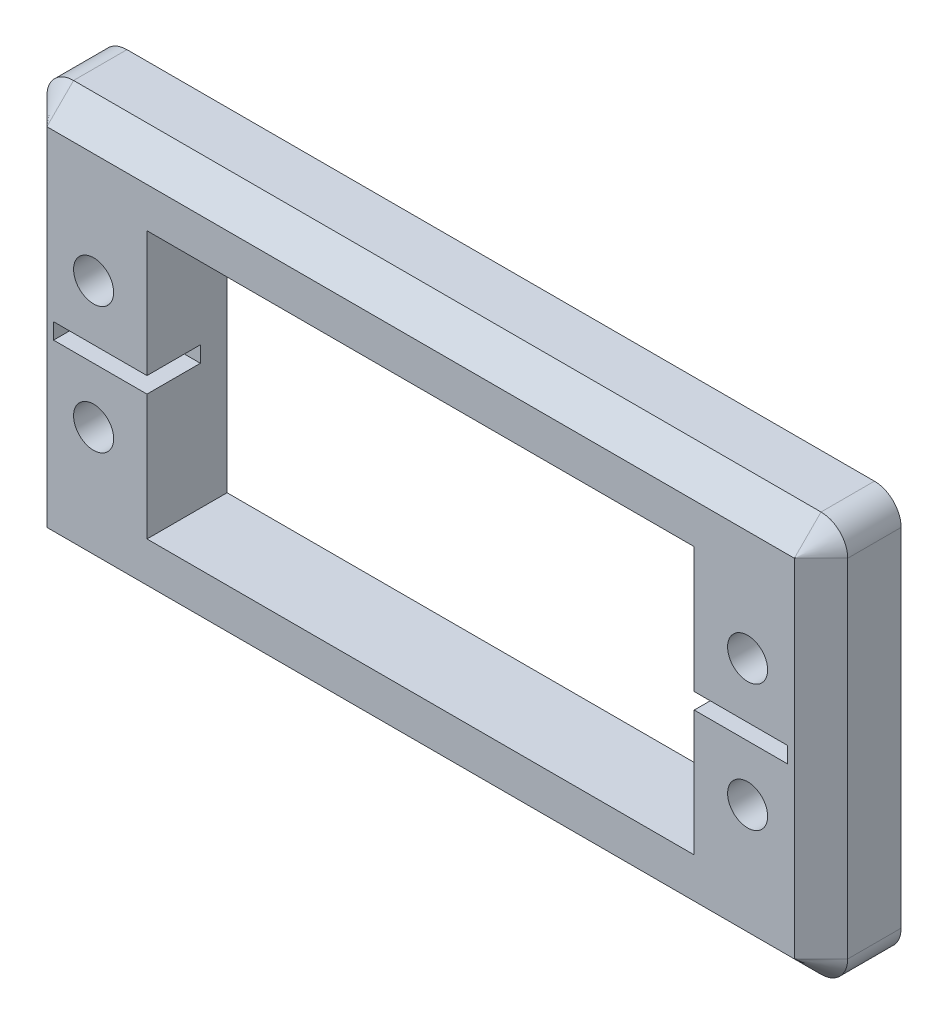
ISO-10303-21;
HEADER;
FILE_DESCRIPTION(('STEP AP214'),'2;1');
FILE_NAME('part.step','',(''),(''),'','','');
FILE_SCHEMA(('AUTOMOTIVE_DESIGN { 1 0 10303 214 1 1 1 1 }'));
ENDSEC;
DATA;
#1=APPLICATION_CONTEXT('core data for automotive mechanical design processes');
#2=APPLICATION_PROTOCOL_DEFINITION('international standard','automotive_design',2000,#1);
#3=PRODUCT_CONTEXT('',#1,'mechanical');
#4=PRODUCT('Part','Part','',(#3));
#5=PRODUCT_RELATED_PRODUCT_CATEGORY('part','',(#4));
#6=PRODUCT_DEFINITION_FORMATION('','',#4);
#7=PRODUCT_DEFINITION_CONTEXT('part definition',#1,'design');
#8=PRODUCT_DEFINITION('design','',#6,#7);
#9=PRODUCT_DEFINITION_SHAPE('','',#8);
#10=(LENGTH_UNIT() NAMED_UNIT(*) SI_UNIT(.MILLI.,.METRE.));
#11=(NAMED_UNIT(*) PLANE_ANGLE_UNIT() SI_UNIT($,.RADIAN.));
#12=(NAMED_UNIT(*) SI_UNIT($,.STERADIAN.) SOLID_ANGLE_UNIT());
#13=UNCERTAINTY_MEASURE_WITH_UNIT(LENGTH_MEASURE(1.E-05),#10,'distance_accuracy_value','');
#14=(GEOMETRIC_REPRESENTATION_CONTEXT(3) GLOBAL_UNCERTAINTY_ASSIGNED_CONTEXT((#13)) GLOBAL_UNIT_ASSIGNED_CONTEXT((#10,
#11,#12)) REPRESENTATION_CONTEXT('',''));
#15=CARTESIAN_POINT('',(0.,0.,0.));
#16=DIRECTION('',(0.,0.,1.));
#17=DIRECTION('',(1.,0.,0.));
#18=AXIS2_PLACEMENT_3D('',#15,#16,#17);
#19=CARTESIAN_POINT('',(30.,-15.,10.));
#20=DIRECTION('',(-1.,0.,0.));
#21=DIRECTION('',(0.,0.,1.));
#22=AXIS2_PLACEMENT_3D('',#19,#20,#21);
#23=PLANE('',#22);
#24=DIRECTION('',(0.,-1.,0.));
#25=VECTOR('',#24,1.);
#26=CARTESIAN_POINT('',(30.,-15.,4.));
#27=LINE('',#26,#25);
#28=CARTESIAN_POINT('',(30.,13.,4.));
#29=VERTEX_POINT('',#28);
#30=CARTESIAN_POINT('',(30.,-13.,4.));
#31=VERTEX_POINT('',#30);
#32=EDGE_CURVE('E439',#29,#31,#27,.T.);
#33=ORIENTED_EDGE('',*,*,#32,.F.);
#34=DIRECTION('',(0.,0.,-1.));
#35=VECTOR('',#34,1.);
#36=CARTESIAN_POINT('',(30.,13.,10.));
#37=LINE('',#36,#35);
#38=CARTESIAN_POINT('',(30.,13.,7.99999999999998));
#39=VERTEX_POINT('',#38);
#40=EDGE_CURVE('E216',#29,#39,#37,.F.);
#41=ORIENTED_EDGE('',*,*,#40,.T.);
#42=DIRECTION('',(0.,-1.,0.));
#43=VECTOR('',#42,1.);
#44=CARTESIAN_POINT('',(30.,-15.,7.99999999999998));
#45=LINE('',#44,#43);
#46=CARTESIAN_POINT('',(30.,-13.,7.99999999999998));
#47=VERTEX_POINT('',#46);
#48=EDGE_CURVE('E245',#39,#47,#45,.T.);
#49=ORIENTED_EDGE('',*,*,#48,.T.);
#50=DIRECTION('',(0.,0.,-1.));
#51=VECTOR('',#50,1.);
#52=CARTESIAN_POINT('',(30.,-13.,10.));
#53=LINE('',#52,#51);
#54=EDGE_CURVE('E207',#47,#31,#53,.T.);
#55=ORIENTED_EDGE('',*,*,#54,.T.);
#56=EDGE_LOOP('',(#33,#41,#49,#55));
#57=FACE_BOUND('',#56,.T.);
#58=ADVANCED_FACE('F38',(#57),#23,.F.);
#59=CARTESIAN_POINT('',(-30.,15.,10.));
#60=DIRECTION('',(0.,-1.,0.));
#61=DIRECTION('',(0.,0.,-1.));
#62=AXIS2_PLACEMENT_3D('',#59,#60,#61);
#63=PLANE('',#62);
#64=DIRECTION('',(1.,0.,0.));
#65=VECTOR('',#64,1.);
#66=CARTESIAN_POINT('',(-30.,15.,4.));
#67=LINE('',#66,#65);
#68=CARTESIAN_POINT('',(-28.,15.,4.));
#69=VERTEX_POINT('',#68);
#70=CARTESIAN_POINT('',(28.,15.,4.));
#71=VERTEX_POINT('',#70);
#72=EDGE_CURVE('E186',#69,#71,#67,.T.);
#73=ORIENTED_EDGE('',*,*,#72,.F.);
#74=DIRECTION('',(0.,0.,-1.));
#75=VECTOR('',#74,1.);
#76=CARTESIAN_POINT('',(-28.,15.,10.));
#77=LINE('',#76,#75);
#78=CARTESIAN_POINT('',(-28.,15.,7.99999999999998));
#79=VERTEX_POINT('',#78);
#80=EDGE_CURVE('E195',#69,#79,#77,.F.);
#81=ORIENTED_EDGE('',*,*,#80,.T.);
#82=DIRECTION('',(1.,0.,0.));
#83=VECTOR('',#82,1.);
#84=CARTESIAN_POINT('',(-30.,15.,7.99999999999998));
#85=LINE('',#84,#83);
#86=CARTESIAN_POINT('',(28.,15.,7.99999999999998));
#87=VERTEX_POINT('',#86);
#88=EDGE_CURVE('E47',#79,#87,#85,.T.);
#89=ORIENTED_EDGE('',*,*,#88,.T.);
#90=DIRECTION('',(0.,0.,-1.));
#91=VECTOR('',#90,1.);
#92=CARTESIAN_POINT('',(28.,15.,10.));
#93=LINE('',#92,#91);
#94=EDGE_CURVE('E198',#87,#71,#93,.T.);
#95=ORIENTED_EDGE('',*,*,#94,.T.);
#96=EDGE_LOOP('',(#73,#81,#89,#95));
#97=FACE_BOUND('',#96,.T.);
#98=ADVANCED_FACE('F194',(#97),#63,.F.);
#99=CARTESIAN_POINT('',(-30.,-15.,10.));
#100=DIRECTION('',(1.,0.,0.));
#101=DIRECTION('',(0.,0.,-1.));
#102=AXIS2_PLACEMENT_3D('',#99,#100,#101);
#103=PLANE('',#102);
#104=DIRECTION('',(0.,1.,0.));
#105=VECTOR('',#104,1.);
#106=CARTESIAN_POINT('',(-30.,-15.,4.));
#107=LINE('',#106,#105);
#108=CARTESIAN_POINT('',(-30.,-13.,4.));
#109=VERTEX_POINT('',#108);
#110=CARTESIAN_POINT('',(-30.,13.,4.));
#111=VERTEX_POINT('',#110);
#112=EDGE_CURVE('E62',#109,#111,#107,.T.);
#113=ORIENTED_EDGE('',*,*,#112,.F.);
#114=DIRECTION('',(0.,0.,-1.));
#115=VECTOR('',#114,1.);
#116=CARTESIAN_POINT('',(-30.,-13.,10.));
#117=LINE('',#116,#115);
#118=CARTESIAN_POINT('',(-30.,-13.,7.99999999999998));
#119=VERTEX_POINT('',#118);
#120=EDGE_CURVE('E225',#109,#119,#117,.F.);
#121=ORIENTED_EDGE('',*,*,#120,.T.);
#122=DIRECTION('',(0.,1.,0.));
#123=VECTOR('',#122,1.);
#124=CARTESIAN_POINT('',(-30.,-15.,7.99999999999998));
#125=LINE('',#124,#123);
#126=CARTESIAN_POINT('',(-30.,13.,7.99999999999998));
#127=VERTEX_POINT('',#126);
#128=EDGE_CURVE('E247',#119,#127,#125,.T.);
#129=ORIENTED_EDGE('',*,*,#128,.T.);
#130=DIRECTION('',(0.,0.,-1.));
#131=VECTOR('',#130,1.);
#132=CARTESIAN_POINT('',(-30.,13.,10.));
#133=LINE('',#132,#131);
#134=EDGE_CURVE('E223',#127,#111,#133,.T.);
#135=ORIENTED_EDGE('',*,*,#134,.T.);
#136=EDGE_LOOP('',(#113,#121,#129,#135));
#137=FACE_BOUND('',#136,.T.);
#138=ADVANCED_FACE('F496',(#137),#103,.F.);
#139=CARTESIAN_POINT('',(-30.,-15.,10.));
#140=DIRECTION('',(0.,1.,0.));
#141=DIRECTION('',(0.,0.,1.));
#142=AXIS2_PLACEMENT_3D('',#139,#140,#141);
#143=PLANE('',#142);
#144=DIRECTION('',(-1.,0.,0.));
#145=VECTOR('',#144,1.);
#146=CARTESIAN_POINT('',(-30.,-15.,4.));
#147=LINE('',#146,#145);
#148=CARTESIAN_POINT('',(28.,-15.,4.));
#149=VERTEX_POINT('',#148);
#150=CARTESIAN_POINT('',(-28.,-15.,4.));
#151=VERTEX_POINT('',#150);
#152=EDGE_CURVE('E441',#149,#151,#147,.T.);
#153=ORIENTED_EDGE('',*,*,#152,.F.);
#154=DIRECTION('',(0.,0.,-1.));
#155=VECTOR('',#154,1.);
#156=CARTESIAN_POINT('',(28.,-15.,10.));
#157=LINE('',#156,#155);
#158=CARTESIAN_POINT('',(28.,-15.,7.99999999999998));
#159=VERTEX_POINT('',#158);
#160=EDGE_CURVE('E221',#149,#159,#157,.F.);
#161=ORIENTED_EDGE('',*,*,#160,.T.);
#162=DIRECTION('',(-1.,0.,0.));
#163=VECTOR('',#162,1.);
#164=CARTESIAN_POINT('',(-30.,-15.,7.99999999999998));
#165=LINE('',#164,#163);
#166=CARTESIAN_POINT('',(-28.,-15.,7.99999999999998));
#167=VERTEX_POINT('',#166);
#168=EDGE_CURVE('E236',#159,#167,#165,.T.);
#169=ORIENTED_EDGE('',*,*,#168,.T.);
#170=DIRECTION('',(0.,0.,-1.));
#171=VECTOR('',#170,1.);
#172=CARTESIAN_POINT('',(-28.,-15.,10.));
#173=LINE('',#172,#171);
#174=EDGE_CURVE('E218',#167,#151,#173,.T.);
#175=ORIENTED_EDGE('',*,*,#174,.T.);
#176=EDGE_LOOP('',(#153,#161,#169,#175));
#177=FACE_BOUND('',#176,.T.);
#178=ADVANCED_FACE('F453',(#177),#143,.F.);
#179=CARTESIAN_POINT('',(20.5,-10.,0.));
#180=DIRECTION('',(1.,0.,0.));
#181=DIRECTION('',(0.,0.,-1.));
#182=AXIS2_PLACEMENT_3D('',#179,#180,#181);
#183=PLANE('',#182);
#184=DIRECTION('',(0.,1.,0.));
#185=VECTOR('',#184,1.);
#186=CARTESIAN_POINT('',(20.5,-10.,4.));
#187=LINE('',#186,#185);
#188=CARTESIAN_POINT('',(20.5,-10.,4.));
#189=VERTEX_POINT('',#188);
#190=CARTESIAN_POINT('',(20.5,10.,4.));
#191=VERTEX_POINT('',#190);
#192=EDGE_CURVE('E54',#189,#191,#187,.T.);
#193=ORIENTED_EDGE('',*,*,#192,.F.);
#194=DIRECTION('',(0.,0.,1.));
#195=VECTOR('',#194,1.);
#196=CARTESIAN_POINT('',(20.5,-10.,0.));
#197=LINE('',#196,#195);
#198=CARTESIAN_POINT('',(20.5,-10.,10.));
#199=VERTEX_POINT('',#198);
#200=EDGE_CURVE('E358',#189,#199,#197,.T.);
#201=ORIENTED_EDGE('',*,*,#200,.T.);
#202=DIRECTION('',(0.,1.,0.));
#203=VECTOR('',#202,1.);
#204=CARTESIAN_POINT('',(20.5,-10.,10.));
#205=LINE('',#204,#203);
#206=CARTESIAN_POINT('',(20.5,-0.6,10.));
#207=VERTEX_POINT('',#206);
#208=EDGE_CURVE('E344',#199,#207,#205,.T.);
#209=ORIENTED_EDGE('',*,*,#208,.T.);
#210=DIRECTION('',(0.,0.,-1.));
#211=VECTOR('',#210,1.);
#212=CARTESIAN_POINT('',(20.5,-0.6,0.));
#213=LINE('',#212,#211);
#214=CARTESIAN_POINT('',(20.5,-0.6,6.));
#215=VERTEX_POINT('',#214);
#216=EDGE_CURVE('E210',#207,#215,#213,.T.);
#217=ORIENTED_EDGE('',*,*,#216,.T.);
#218=DIRECTION('',(0.,-1.,0.));
#219=VECTOR('',#218,1.);
#220=CARTESIAN_POINT('',(20.5,-10.,6.));
#221=LINE('',#220,#219);
#222=CARTESIAN_POINT('',(20.5,0.6,6.));
#223=VERTEX_POINT('',#222);
#224=EDGE_CURVE('E374',#223,#215,#221,.T.);
#225=ORIENTED_EDGE('',*,*,#224,.F.);
#226=DIRECTION('',(0.,0.,1.));
#227=VECTOR('',#226,1.);
#228=CARTESIAN_POINT('',(20.5,0.6,0.));
#229=LINE('',#228,#227);
#230=CARTESIAN_POINT('',(20.5,0.6,10.));
#231=VERTEX_POINT('',#230);
#232=EDGE_CURVE('E205',#223,#231,#229,.T.);
#233=ORIENTED_EDGE('',*,*,#232,.T.);
#234=CARTESIAN_POINT('',(20.5,10.,10.));
#235=VERTEX_POINT('',#234);
#236=EDGE_CURVE('E342',#231,#235,#205,.T.);
#237=ORIENTED_EDGE('',*,*,#236,.T.);
#238=DIRECTION('',(0.,0.,1.));
#239=VECTOR('',#238,1.);
#240=CARTESIAN_POINT('',(20.5,10.,0.));
#241=LINE('',#240,#239);
#242=EDGE_CURVE('E357',#191,#235,#241,.T.);
#243=ORIENTED_EDGE('',*,*,#242,.F.);
#244=EDGE_LOOP('',(#193,#201,#209,#217,#225,#233,#237,#243));
#245=FACE_BOUND('',#244,.T.);
#246=ADVANCED_FACE('F378',(#245),#183,.F.);
#247=CARTESIAN_POINT('',(-20.5,-10.,0.));
#248=DIRECTION('',(0.,-1.,0.));
#249=DIRECTION('',(0.,0.,-1.));
#250=AXIS2_PLACEMENT_3D('',#247,#248,#249);
#251=PLANE('',#250);
#252=DIRECTION('',(1.,0.,0.));
#253=VECTOR('',#252,1.);
#254=CARTESIAN_POINT('',(-20.5,-10.,4.));
#255=LINE('',#254,#253);
#256=CARTESIAN_POINT('',(-20.5,-10.,4.));
#257=VERTEX_POINT('',#256);
#258=EDGE_CURVE('E410',#257,#189,#255,.T.);
#259=ORIENTED_EDGE('',*,*,#258,.F.);
#260=DIRECTION('',(0.,0.,1.));
#261=VECTOR('',#260,1.);
#262=CARTESIAN_POINT('',(-20.5,-10.,0.));
#263=LINE('',#262,#261);
#264=CARTESIAN_POINT('',(-20.5,-10.,10.));
#265=VERTEX_POINT('',#264);
#266=EDGE_CURVE('E361',#257,#265,#263,.T.);
#267=ORIENTED_EDGE('',*,*,#266,.T.);
#268=DIRECTION('',(1.,0.,0.));
#269=VECTOR('',#268,1.);
#270=CARTESIAN_POINT('',(-20.5,-10.,10.));
#271=LINE('',#270,#269);
#272=EDGE_CURVE('E354',#265,#199,#271,.T.);
#273=ORIENTED_EDGE('',*,*,#272,.T.);
#274=ORIENTED_EDGE('',*,*,#200,.F.);
#275=EDGE_LOOP('',(#259,#267,#273,#274));
#276=FACE_BOUND('',#275,.T.);
#277=ADVANCED_FACE('F413',(#276),#251,.F.);
#278=CARTESIAN_POINT('',(-20.5,-10.,0.));
#279=DIRECTION('',(-1.,0.,0.));
#280=DIRECTION('',(0.,0.,1.));
#281=AXIS2_PLACEMENT_3D('',#278,#279,#280);
#282=PLANE('',#281);
#283=DIRECTION('',(0.,-1.,0.));
#284=VECTOR('',#283,1.);
#285=CARTESIAN_POINT('',(-20.5,-10.,4.));
#286=LINE('',#285,#284);
#287=CARTESIAN_POINT('',(-20.5,10.,4.));
#288=VERTEX_POINT('',#287);
#289=EDGE_CURVE('E431',#288,#257,#286,.T.);
#290=ORIENTED_EDGE('',*,*,#289,.F.);
#291=DIRECTION('',(0.,0.,1.));
#292=VECTOR('',#291,1.);
#293=CARTESIAN_POINT('',(-20.5,10.,0.));
#294=LINE('',#293,#292);
#295=CARTESIAN_POINT('',(-20.5,10.,10.));
#296=VERTEX_POINT('',#295);
#297=EDGE_CURVE('E363',#288,#296,#294,.T.);
#298=ORIENTED_EDGE('',*,*,#297,.T.);
#299=DIRECTION('',(0.,-1.,0.));
#300=VECTOR('',#299,1.);
#301=CARTESIAN_POINT('',(-20.5,-10.,10.));
#302=LINE('',#301,#300);
#303=CARTESIAN_POINT('',(-20.5,0.6,10.));
#304=VERTEX_POINT('',#303);
#305=EDGE_CURVE('E351',#296,#304,#302,.T.);
#306=ORIENTED_EDGE('',*,*,#305,.T.);
#307=DIRECTION('',(0.,0.,-1.));
#308=VECTOR('',#307,1.);
#309=CARTESIAN_POINT('',(-20.5,0.6,0.));
#310=LINE('',#309,#308);
#311=CARTESIAN_POINT('',(-20.5,0.6,6.));
#312=VERTEX_POINT('',#311);
#313=EDGE_CURVE('E371',#304,#312,#310,.T.);
#314=ORIENTED_EDGE('',*,*,#313,.T.);
#315=DIRECTION('',(0.,-1.,0.));
#316=VECTOR('',#315,1.);
#317=CARTESIAN_POINT('',(-20.5,-10.,6.));
#318=LINE('',#317,#316);
#319=CARTESIAN_POINT('',(-20.5,-0.6,6.));
#320=VERTEX_POINT('',#319);
#321=EDGE_CURVE('E360',#312,#320,#318,.T.);
#322=ORIENTED_EDGE('',*,*,#321,.T.);
#323=DIRECTION('',(0.,0.,1.));
#324=VECTOR('',#323,1.);
#325=CARTESIAN_POINT('',(-20.5,-0.6,0.));
#326=LINE('',#325,#324);
#327=CARTESIAN_POINT('',(-20.5,-0.6,10.));
#328=VERTEX_POINT('',#327);
#329=EDGE_CURVE('E368',#320,#328,#326,.T.);
#330=ORIENTED_EDGE('',*,*,#329,.T.);
#331=EDGE_CURVE('E350',#328,#265,#302,.T.);
#332=ORIENTED_EDGE('',*,*,#331,.T.);
#333=ORIENTED_EDGE('',*,*,#266,.F.);
#334=EDGE_LOOP('',(#290,#298,#306,#314,#322,#330,#332,#333));
#335=FACE_BOUND('',#334,.T.);
#336=ADVANCED_FACE('F421',(#335),#282,.F.);
#337=CARTESIAN_POINT('',(-20.5,10.,0.));
#338=DIRECTION('',(0.,1.,0.));
#339=DIRECTION('',(0.,0.,1.));
#340=AXIS2_PLACEMENT_3D('',#337,#338,#339);
#341=PLANE('',#340);
#342=DIRECTION('',(-1.,0.,0.));
#343=VECTOR('',#342,1.);
#344=CARTESIAN_POINT('',(-20.5,10.,4.));
#345=LINE('',#344,#343);
#346=EDGE_CURVE('E408',#191,#288,#345,.T.);
#347=ORIENTED_EDGE('',*,*,#346,.F.);
#348=ORIENTED_EDGE('',*,*,#242,.T.);
#349=DIRECTION('',(-1.,0.,0.));
#350=VECTOR('',#349,1.);
#351=CARTESIAN_POINT('',(-20.5,10.,10.));
#352=LINE('',#351,#350);
#353=EDGE_CURVE('E347',#235,#296,#352,.T.);
#354=ORIENTED_EDGE('',*,*,#353,.T.);
#355=ORIENTED_EDGE('',*,*,#297,.F.);
#356=EDGE_LOOP('',(#347,#348,#354,#355));
#357=FACE_BOUND('',#356,.T.);
#358=ADVANCED_FACE('F407',(#357),#341,.F.);
#359=CARTESIAN_POINT('',(28.,13.,10.));
#360=DIRECTION('',(0.,0.,-1.));
#361=DIRECTION('',(-1.,0.,0.));
#362=AXIS2_PLACEMENT_3D('',#359,#360,#361);
#363=CYLINDRICAL_SURFACE('',#362,2.);
#364=ORIENTED_EDGE('',*,*,#40,.F.);
#365=CARTESIAN_POINT('',(28.,13.,4.));
#366=DIRECTION('',(0.,0.,-1.));
#367=DIRECTION('',(-1.,0.,0.));
#368=AXIS2_PLACEMENT_3D('',#365,#366,#367);
#369=CIRCLE('',#368,2.);
#370=EDGE_CURVE('E443',#29,#71,#369,.F.);
#371=ORIENTED_EDGE('',*,*,#370,.T.);
#372=ORIENTED_EDGE('',*,*,#94,.F.);
#373=CARTESIAN_POINT('',(28.,13.,7.99999999999998));
#374=DIRECTION('',(0.,0.,-1.));
#375=DIRECTION('',(-1.,0.,0.));
#376=AXIS2_PLACEMENT_3D('',#373,#374,#375);
#377=CIRCLE('',#376,2.);
#378=EDGE_CURVE('E249',#87,#39,#377,.T.);
#379=ORIENTED_EDGE('',*,*,#378,.T.);
#380=EDGE_LOOP('',(#364,#371,#372,#379));
#381=FACE_BOUND('',#380,.T.);
#382=ADVANCED_FACE('F501',(#381),#363,.T.);
#383=CARTESIAN_POINT('',(28.,-13.,10.));
#384=DIRECTION('',(0.,0.,-1.));
#385=DIRECTION('',(-1.,0.,0.));
#386=AXIS2_PLACEMENT_3D('',#383,#384,#385);
#387=CYLINDRICAL_SURFACE('',#386,2.);
#388=ORIENTED_EDGE('',*,*,#160,.F.);
#389=CARTESIAN_POINT('',(28.,-13.,4.));
#390=DIRECTION('',(0.,0.,-1.));
#391=DIRECTION('',(-1.,0.,0.));
#392=AXIS2_PLACEMENT_3D('',#389,#390,#391);
#393=CIRCLE('',#392,2.);
#394=EDGE_CURVE('E434',#149,#31,#393,.F.);
#395=ORIENTED_EDGE('',*,*,#394,.T.);
#396=ORIENTED_EDGE('',*,*,#54,.F.);
#397=CARTESIAN_POINT('',(28.,-13.,7.99999999999998));
#398=DIRECTION('',(0.,0.,-1.));
#399=DIRECTION('',(-1.,0.,0.));
#400=AXIS2_PLACEMENT_3D('',#397,#398,#399);
#401=CIRCLE('',#400,2.);
#402=EDGE_CURVE('E239',#47,#159,#401,.T.);
#403=ORIENTED_EDGE('',*,*,#402,.T.);
#404=EDGE_LOOP('',(#388,#395,#396,#403));
#405=FACE_BOUND('',#404,.T.);
#406=ADVANCED_FACE('F504',(#405),#387,.T.);
#407=CARTESIAN_POINT('',(-28.,-13.,10.));
#408=DIRECTION('',(0.,0.,-1.));
#409=DIRECTION('',(-1.,0.,0.));
#410=AXIS2_PLACEMENT_3D('',#407,#408,#409);
#411=CYLINDRICAL_SURFACE('',#410,2.);
#412=ORIENTED_EDGE('',*,*,#120,.F.);
#413=CARTESIAN_POINT('',(-28.,-13.,4.));
#414=DIRECTION('',(0.,0.,-1.));
#415=DIRECTION('',(-1.,0.,0.));
#416=AXIS2_PLACEMENT_3D('',#413,#414,#415);
#417=CIRCLE('',#416,2.);
#418=EDGE_CURVE('E199',#109,#151,#417,.F.);
#419=ORIENTED_EDGE('',*,*,#418,.T.);
#420=ORIENTED_EDGE('',*,*,#174,.F.);
#421=CARTESIAN_POINT('',(-28.,-13.,7.99999999999998));
#422=DIRECTION('',(0.,0.,-1.));
#423=DIRECTION('',(-1.,0.,0.));
#424=AXIS2_PLACEMENT_3D('',#421,#422,#423);
#425=CIRCLE('',#424,2.);
#426=EDGE_CURVE('E242',#167,#119,#425,.T.);
#427=ORIENTED_EDGE('',*,*,#426,.T.);
#428=EDGE_LOOP('',(#412,#419,#420,#427));
#429=FACE_BOUND('',#428,.T.);
#430=ADVANCED_FACE('F450',(#429),#411,.T.);
#431=CARTESIAN_POINT('',(-28.,13.,10.));
#432=DIRECTION('',(0.,0.,-1.));
#433=DIRECTION('',(-1.,0.,0.));
#434=AXIS2_PLACEMENT_3D('',#431,#432,#433);
#435=CYLINDRICAL_SURFACE('',#434,2.);
#436=ORIENTED_EDGE('',*,*,#80,.F.);
#437=CARTESIAN_POINT('',(-28.,13.,4.));
#438=DIRECTION('',(0.,0.,-1.));
#439=DIRECTION('',(-1.,0.,0.));
#440=AXIS2_PLACEMENT_3D('',#437,#438,#439);
#441=CIRCLE('',#440,2.);
#442=EDGE_CURVE('E11',#69,#111,#441,.F.);
#443=ORIENTED_EDGE('',*,*,#442,.T.);
#444=ORIENTED_EDGE('',*,*,#134,.F.);
#445=CARTESIAN_POINT('',(-28.,13.,7.99999999999998));
#446=DIRECTION('',(0.,0.,-1.));
#447=DIRECTION('',(-1.,0.,0.));
#448=AXIS2_PLACEMENT_3D('',#445,#446,#447);
#449=CIRCLE('',#448,2.);
#450=EDGE_CURVE('E203',#127,#79,#449,.T.);
#451=ORIENTED_EDGE('',*,*,#450,.T.);
#452=EDGE_LOOP('',(#436,#443,#444,#451));
#453=FACE_BOUND('',#452,.T.);
#454=ADVANCED_FACE('F201',(#453),#435,.T.);
#455=CARTESIAN_POINT('',(0.,0.,10.));
#456=DIRECTION('',(0.,0.,-1.));
#457=DIRECTION('',(-1.,0.,0.));
#458=AXIS2_PLACEMENT_3D('',#455,#456,#457);
#459=PLANE('',#458);
#460=DIRECTION('',(0.,-1.,0.));
#461=VECTOR('',#460,1.);
#462=CARTESIAN_POINT('',(-28.,0.,10.));
#463=LINE('',#462,#461);
#464=CARTESIAN_POINT('',(-28.,13.,10.));
#465=VERTEX_POINT('',#464);
#466=CARTESIAN_POINT('',(-28.,-13.,10.));
#467=VERTEX_POINT('',#466);
#468=EDGE_CURVE('E229',#465,#467,#463,.T.);
#469=ORIENTED_EDGE('',*,*,#468,.T.);
#470=DIRECTION('',(1.,0.,0.));
#471=VECTOR('',#470,1.);
#472=CARTESIAN_POINT('',(0.,-13.,10.));
#473=LINE('',#472,#471);
#474=CARTESIAN_POINT('',(28.,-13.,10.));
#475=VERTEX_POINT('',#474);
#476=EDGE_CURVE('E233',#467,#475,#473,.T.);
#477=ORIENTED_EDGE('',*,*,#476,.T.);
#478=DIRECTION('',(0.,1.,0.));
#479=VECTOR('',#478,1.);
#480=CARTESIAN_POINT('',(28.,0.,10.));
#481=LINE('',#480,#479);
#482=CARTESIAN_POINT('',(28.,13.,10.));
#483=VERTEX_POINT('',#482);
#484=EDGE_CURVE('E231',#475,#483,#481,.T.);
#485=ORIENTED_EDGE('',*,*,#484,.T.);
#486=DIRECTION('',(-1.,0.,0.));
#487=VECTOR('',#486,1.);
#488=CARTESIAN_POINT('',(0.,13.,10.));
#489=LINE('',#488,#487);
#490=EDGE_CURVE('E227',#483,#465,#489,.T.);
#491=ORIENTED_EDGE('',*,*,#490,.T.);
#492=EDGE_LOOP('',(#469,#477,#485,#491));
#493=FACE_BOUND('',#492,.T.);
#494=CARTESIAN_POINT('',(-24.5,4.75,10.));
#495=DIRECTION('',(0.,0.,1.));
#496=DIRECTION('',(1.,0.,0.));
#497=AXIS2_PLACEMENT_3D('',#494,#495,#496);
#498=CIRCLE('',#497,1.5);
#499=CARTESIAN_POINT('',(-23.,4.75,10.));
#500=VERTEX_POINT('',#499);
#501=EDGE_CURVE('E292',#500,#500,#498,.T.);
#502=ORIENTED_EDGE('',*,*,#501,.F.);
#503=EDGE_LOOP('',(#502));
#504=FACE_BOUND('',#503,.T.);
#505=CARTESIAN_POINT('',(-24.5,-4.75000000000001,10.));
#506=DIRECTION('',(0.,0.,1.));
#507=DIRECTION('',(-1.,0.,0.));
#508=AXIS2_PLACEMENT_3D('',#505,#506,#507);
#509=CIRCLE('',#508,1.5);
#510=CARTESIAN_POINT('',(-26.,-4.75000000000001,10.));
#511=VERTEX_POINT('',#510);
#512=EDGE_CURVE('E298',#511,#511,#509,.T.);
#513=ORIENTED_EDGE('',*,*,#512,.F.);
#514=EDGE_LOOP('',(#513));
#515=FACE_BOUND('',#514,.T.);
#516=CARTESIAN_POINT('',(24.5,-4.75000000000001,10.));
#517=DIRECTION('',(0.,0.,1.));
#518=DIRECTION('',(1.,0.,0.));
#519=AXIS2_PLACEMENT_3D('',#516,#517,#518);
#520=CIRCLE('',#519,1.5);
#521=CARTESIAN_POINT('',(26.,-4.75000000000001,10.));
#522=VERTEX_POINT('',#521);
#523=EDGE_CURVE('E304',#522,#522,#520,.T.);
#524=ORIENTED_EDGE('',*,*,#523,.F.);
#525=EDGE_LOOP('',(#524));
#526=FACE_BOUND('',#525,.T.);
#527=CARTESIAN_POINT('',(24.5,4.75000000000001,10.));
#528=DIRECTION('',(0.,0.,1.));
#529=DIRECTION('',(-1.,0.,0.));
#530=AXIS2_PLACEMENT_3D('',#527,#528,#529);
#531=CIRCLE('',#530,1.5);
#532=CARTESIAN_POINT('',(23.,4.75000000000001,10.));
#533=VERTEX_POINT('',#532);
#534=EDGE_CURVE('E274',#533,#533,#531,.T.);
#535=ORIENTED_EDGE('',*,*,#534,.F.);
#536=EDGE_LOOP('',(#535));
#537=FACE_BOUND('',#536,.T.);
#538=ORIENTED_EDGE('',*,*,#236,.F.);
#539=DIRECTION('',(-1.,0.,0.));
#540=VECTOR('',#539,1.);
#541=CARTESIAN_POINT('',(13.5,0.6,10.));
#542=LINE('',#541,#540);
#543=CARTESIAN_POINT('',(27.5,0.6,10.));
#544=VERTEX_POINT('',#543);
#545=EDGE_CURVE('E311',#544,#231,#542,.T.);
#546=ORIENTED_EDGE('',*,*,#545,.F.);
#547=DIRECTION('',(0.,1.,0.));
#548=VECTOR('',#547,1.);
#549=CARTESIAN_POINT('',(27.5,0.6,10.));
#550=LINE('',#549,#548);
#551=CARTESIAN_POINT('',(27.5,-0.6,10.));
#552=VERTEX_POINT('',#551);
#553=EDGE_CURVE('E318',#552,#544,#550,.T.);
#554=ORIENTED_EDGE('',*,*,#553,.F.);
#555=DIRECTION('',(1.,0.,0.));
#556=VECTOR('',#555,1.);
#557=CARTESIAN_POINT('',(13.5,-0.6,10.));
#558=LINE('',#557,#556);
#559=EDGE_CURVE('E284',#207,#552,#558,.T.);
#560=ORIENTED_EDGE('',*,*,#559,.F.);
#561=ORIENTED_EDGE('',*,*,#208,.F.);
#562=ORIENTED_EDGE('',*,*,#272,.F.);
#563=ORIENTED_EDGE('',*,*,#331,.F.);
#564=DIRECTION('',(1.,0.,0.));
#565=VECTOR('',#564,1.);
#566=CARTESIAN_POINT('',(-13.5,-0.6,10.));
#567=LINE('',#566,#565);
#568=CARTESIAN_POINT('',(-27.5,-0.6,10.));
#569=VERTEX_POINT('',#568);
#570=EDGE_CURVE('E336',#569,#328,#567,.T.);
#571=ORIENTED_EDGE('',*,*,#570,.F.);
#572=DIRECTION('',(0.,-1.,0.));
#573=VECTOR('',#572,1.);
#574=CARTESIAN_POINT('',(-27.5,0.6,10.));
#575=LINE('',#574,#573);
#576=CARTESIAN_POINT('',(-27.5,0.6,10.));
#577=VERTEX_POINT('',#576);
#578=EDGE_CURVE('E291',#577,#569,#575,.T.);
#579=ORIENTED_EDGE('',*,*,#578,.F.);
#580=DIRECTION('',(-1.,0.,0.));
#581=VECTOR('',#580,1.);
#582=CARTESIAN_POINT('',(-13.5,0.6,10.));
#583=LINE('',#582,#581);
#584=EDGE_CURVE('E329',#304,#577,#583,.T.);
#585=ORIENTED_EDGE('',*,*,#584,.F.);
#586=ORIENTED_EDGE('',*,*,#305,.F.);
#587=ORIENTED_EDGE('',*,*,#353,.F.);
#588=EDGE_LOOP('',(#538,#546,#554,#560,#561,#562,#563,#571,#579,#585,#586,#587));
#589=FACE_BOUND('',#588,.T.);
#590=ADVANCED_FACE('F388',(#493,#504,#515,#526,#537,#589),#459,.F.);
#591=CARTESIAN_POINT('',(-13.5,0.6,6.));
#592=DIRECTION('',(0.,1.,0.));
#593=DIRECTION('',(-1.,0.,0.));
#594=AXIS2_PLACEMENT_3D('',#591,#592,#593);
#595=PLANE('',#594);
#596=ORIENTED_EDGE('',*,*,#584,.T.);
#597=DIRECTION('',(0.,0.,1.));
#598=VECTOR('',#597,1.);
#599=CARTESIAN_POINT('',(-27.5,0.6,6.));
#600=LINE('',#599,#598);
#601=CARTESIAN_POINT('',(-27.5,0.6,6.));
#602=VERTEX_POINT('',#601);
#603=EDGE_CURVE('E339',#602,#577,#600,.T.);
#604=ORIENTED_EDGE('',*,*,#603,.F.);
#605=DIRECTION('',(-1.,0.,0.));
#606=VECTOR('',#605,1.);
#607=CARTESIAN_POINT('',(-13.5,0.6,6.));
#608=LINE('',#607,#606);
#609=EDGE_CURVE('E331',#312,#602,#608,.T.);
#610=ORIENTED_EDGE('',*,*,#609,.F.);
#611=ORIENTED_EDGE('',*,*,#313,.F.);
#612=EDGE_LOOP('',(#596,#604,#610,#611));
#613=FACE_BOUND('',#612,.T.);
#614=ADVANCED_FACE('F596',(#613),#595,.F.);
#615=CARTESIAN_POINT('',(-13.5,-0.6,6.));
#616=DIRECTION('',(0.,-1.,0.));
#617=DIRECTION('',(0.,0.,-1.));
#618=AXIS2_PLACEMENT_3D('',#615,#616,#617);
#619=PLANE('',#618);
#620=DIRECTION('',(1.,0.,0.));
#621=VECTOR('',#620,1.);
#622=CARTESIAN_POINT('',(-13.5,-0.6,6.));
#623=LINE('',#622,#621);
#624=CARTESIAN_POINT('',(-27.5,-0.6,6.));
#625=VERTEX_POINT('',#624);
#626=EDGE_CURVE('E328',#625,#320,#623,.T.);
#627=ORIENTED_EDGE('',*,*,#626,.F.);
#628=DIRECTION('',(0.,0.,1.));
#629=VECTOR('',#628,1.);
#630=CARTESIAN_POINT('',(-27.5,-0.6,6.));
#631=LINE('',#630,#629);
#632=EDGE_CURVE('E333',#625,#569,#631,.T.);
#633=ORIENTED_EDGE('',*,*,#632,.T.);
#634=ORIENTED_EDGE('',*,*,#570,.T.);
#635=ORIENTED_EDGE('',*,*,#329,.F.);
#636=EDGE_LOOP('',(#627,#633,#634,#635));
#637=FACE_BOUND('',#636,.T.);
#638=ADVANCED_FACE('F425',(#637),#619,.F.);
#639=CARTESIAN_POINT('',(0.,0.,6.));
#640=DIRECTION('',(0.,0.,-1.));
#641=DIRECTION('',(-1.,0.,0.));
#642=AXIS2_PLACEMENT_3D('',#639,#640,#641);
#643=PLANE('',#642);
#644=ORIENTED_EDGE('',*,*,#609,.T.);
#645=DIRECTION('',(0.,-1.,0.));
#646=VECTOR('',#645,1.);
#647=CARTESIAN_POINT('',(-27.5,0.6,6.));
#648=LINE('',#647,#646);
#649=EDGE_CURVE('E325',#602,#625,#648,.T.);
#650=ORIENTED_EDGE('',*,*,#649,.T.);
#651=ORIENTED_EDGE('',*,*,#626,.T.);
#652=ORIENTED_EDGE('',*,*,#321,.F.);
#653=EDGE_LOOP('',(#644,#650,#651,#652));
#654=FACE_BOUND('',#653,.T.);
#655=ADVANCED_FACE('F592',(#654),#643,.F.);
#656=CARTESIAN_POINT('',(-27.5,0.6,6.));
#657=DIRECTION('',(-1.,0.,0.));
#658=DIRECTION('',(0.,0.,1.));
#659=AXIS2_PLACEMENT_3D('',#656,#657,#658);
#660=PLANE('',#659);
#661=ORIENTED_EDGE('',*,*,#578,.T.);
#662=ORIENTED_EDGE('',*,*,#632,.F.);
#663=ORIENTED_EDGE('',*,*,#649,.F.);
#664=ORIENTED_EDGE('',*,*,#603,.T.);
#665=EDGE_LOOP('',(#661,#662,#663,#664));
#666=FACE_BOUND('',#665,.T.);
#667=ADVANCED_FACE('F428',(#666),#660,.F.);
#668=CARTESIAN_POINT('',(13.5,0.6,6.));
#669=DIRECTION('',(0.,1.,0.));
#670=DIRECTION('',(-1.,0.,0.));
#671=AXIS2_PLACEMENT_3D('',#668,#669,#670);
#672=PLANE('',#671);
#673=DIRECTION('',(-1.,0.,0.));
#674=VECTOR('',#673,1.);
#675=CARTESIAN_POINT('',(13.5,0.6,6.));
#676=LINE('',#675,#674);
#677=CARTESIAN_POINT('',(27.5,0.6,6.));
#678=VERTEX_POINT('',#677);
#679=EDGE_CURVE('E314',#678,#223,#676,.T.);
#680=ORIENTED_EDGE('',*,*,#679,.F.);
#681=DIRECTION('',(0.,0.,1.));
#682=VECTOR('',#681,1.);
#683=CARTESIAN_POINT('',(27.5,0.6,6.));
#684=LINE('',#683,#682);
#685=EDGE_CURVE('E307',#678,#544,#684,.T.);
#686=ORIENTED_EDGE('',*,*,#685,.T.);
#687=ORIENTED_EDGE('',*,*,#545,.T.);
#688=ORIENTED_EDGE('',*,*,#232,.F.);
#689=EDGE_LOOP('',(#680,#686,#687,#688));
#690=FACE_BOUND('',#689,.T.);
#691=ADVANCED_FACE('F399',(#690),#672,.F.);
#692=CARTESIAN_POINT('',(13.5,-0.6,6.));
#693=DIRECTION('',(0.,-1.,0.));
#694=DIRECTION('',(0.,0.,-1.));
#695=AXIS2_PLACEMENT_3D('',#692,#693,#694);
#696=PLANE('',#695);
#697=ORIENTED_EDGE('',*,*,#559,.T.);
#698=DIRECTION('',(0.,0.,1.));
#699=VECTOR('',#698,1.);
#700=CARTESIAN_POINT('',(27.5,-0.6,6.));
#701=LINE('',#700,#699);
#702=CARTESIAN_POINT('',(27.5,-0.6,6.));
#703=VERTEX_POINT('',#702);
#704=EDGE_CURVE('E316',#703,#552,#701,.T.);
#705=ORIENTED_EDGE('',*,*,#704,.F.);
#706=DIRECTION('',(1.,0.,0.));
#707=VECTOR('',#706,1.);
#708=CARTESIAN_POINT('',(13.5,-0.6,6.));
#709=LINE('',#708,#707);
#710=EDGE_CURVE('E308',#215,#703,#709,.T.);
#711=ORIENTED_EDGE('',*,*,#710,.F.);
#712=ORIENTED_EDGE('',*,*,#216,.F.);
#713=EDGE_LOOP('',(#697,#705,#711,#712));
#714=FACE_BOUND('',#713,.T.);
#715=ADVANCED_FACE('F383',(#714),#696,.F.);
#716=CARTESIAN_POINT('',(0.,0.,6.));
#717=DIRECTION('',(0.,0.,1.));
#718=DIRECTION('',(1.,0.,0.));
#719=AXIS2_PLACEMENT_3D('',#716,#717,#718);
#720=PLANE('',#719);
#721=ORIENTED_EDGE('',*,*,#224,.T.);
#722=ORIENTED_EDGE('',*,*,#710,.T.);
#723=DIRECTION('',(0.,1.,0.));
#724=VECTOR('',#723,1.);
#725=CARTESIAN_POINT('',(27.5,0.6,6.));
#726=LINE('',#725,#724);
#727=EDGE_CURVE('E310',#703,#678,#726,.T.);
#728=ORIENTED_EDGE('',*,*,#727,.T.);
#729=ORIENTED_EDGE('',*,*,#679,.T.);
#730=EDGE_LOOP('',(#721,#722,#728,#729));
#731=FACE_BOUND('',#730,.T.);
#732=ADVANCED_FACE('F396',(#731),#720,.T.);
#733=CARTESIAN_POINT('',(27.5,0.6,6.));
#734=DIRECTION('',(1.,0.,0.));
#735=DIRECTION('',(0.,0.,-1.));
#736=AXIS2_PLACEMENT_3D('',#733,#734,#735);
#737=PLANE('',#736);
#738=ORIENTED_EDGE('',*,*,#553,.T.);
#739=ORIENTED_EDGE('',*,*,#685,.F.);
#740=ORIENTED_EDGE('',*,*,#727,.F.);
#741=ORIENTED_EDGE('',*,*,#704,.T.);
#742=EDGE_LOOP('',(#738,#739,#740,#741));
#743=FACE_BOUND('',#742,.T.);
#744=ADVANCED_FACE('F392',(#743),#737,.F.);
#745=CARTESIAN_POINT('',(24.5,4.75000000000001,6.));
#746=DIRECTION('',(0.,0.,1.));
#747=DIRECTION('',(1.,0.,0.));
#748=AXIS2_PLACEMENT_3D('',#745,#746,#747);
#749=CYLINDRICAL_SURFACE('',#748,1.5);
#750=CARTESIAN_POINT('',(24.5,4.75000000000001,6.));
#751=DIRECTION('',(0.,0.,1.));
#752=DIRECTION('',(-1.,0.,0.));
#753=AXIS2_PLACEMENT_3D('',#750,#751,#752);
#754=CIRCLE('',#753,1.5);
#755=CARTESIAN_POINT('',(23.,4.75000000000001,6.));
#756=VERTEX_POINT('',#755);
#757=EDGE_CURVE('E279',#756,#756,#754,.T.);
#758=ORIENTED_EDGE('',*,*,#757,.F.);
#759=EDGE_LOOP('',(#758));
#760=FACE_BOUND('',#759,.T.);
#761=ORIENTED_EDGE('',*,*,#534,.T.);
#762=EDGE_LOOP('',(#761));
#763=FACE_BOUND('',#762,.T.);
#764=ADVANCED_FACE('F565',(#760,#763),#749,.F.);
#765=CARTESIAN_POINT('',(24.5,4.75000000000001,6.));
#766=DIRECTION('',(0.,0.,-1.));
#767=DIRECTION('',(-1.,0.,0.));
#768=AXIS2_PLACEMENT_3D('',#765,#766,#767);
#769=PLANE('',#768);
#770=ORIENTED_EDGE('',*,*,#757,.T.);
#771=EDGE_LOOP('',(#770));
#772=FACE_BOUND('',#771,.T.);
#773=ADVANCED_FACE('F582',(#772),#769,.F.);
#774=CARTESIAN_POINT('',(24.5,-4.75000000000001,6.));
#775=DIRECTION('',(0.,0.,1.));
#776=DIRECTION('',(1.,0.,0.));
#777=AXIS2_PLACEMENT_3D('',#774,#775,#776);
#778=CYLINDRICAL_SURFACE('',#777,1.5);
#779=CARTESIAN_POINT('',(24.5,-4.75000000000001,6.));
#780=DIRECTION('',(0.,0.,1.));
#781=DIRECTION('',(1.,0.,0.));
#782=AXIS2_PLACEMENT_3D('',#779,#780,#781);
#783=CIRCLE('',#782,1.5);
#784=CARTESIAN_POINT('',(26.,-4.75000000000001,6.));
#785=VERTEX_POINT('',#784);
#786=EDGE_CURVE('E301',#785,#785,#783,.T.);
#787=ORIENTED_EDGE('',*,*,#786,.F.);
#788=EDGE_LOOP('',(#787));
#789=FACE_BOUND('',#788,.T.);
#790=ORIENTED_EDGE('',*,*,#523,.T.);
#791=EDGE_LOOP('',(#790));
#792=FACE_BOUND('',#791,.T.);
#793=ADVANCED_FACE('F578',(#789,#792),#778,.F.);
#794=CARTESIAN_POINT('',(24.5,-4.75000000000001,6.));
#795=DIRECTION('',(0.,0.,1.));
#796=DIRECTION('',(1.,0.,0.));
#797=AXIS2_PLACEMENT_3D('',#794,#795,#796);
#798=PLANE('',#797);
#799=ORIENTED_EDGE('',*,*,#786,.T.);
#800=EDGE_LOOP('',(#799));
#801=FACE_BOUND('',#800,.T.);
#802=ADVANCED_FACE('F574',(#801),#798,.T.);
#803=CARTESIAN_POINT('',(-24.5,-4.75000000000001,6.));
#804=DIRECTION('',(0.,0.,1.));
#805=DIRECTION('',(1.,0.,0.));
#806=AXIS2_PLACEMENT_3D('',#803,#804,#805);
#807=CYLINDRICAL_SURFACE('',#806,1.5);
#808=CARTESIAN_POINT('',(-24.5,-4.75000000000001,6.));
#809=DIRECTION('',(0.,0.,1.));
#810=DIRECTION('',(-1.,0.,0.));
#811=AXIS2_PLACEMENT_3D('',#808,#809,#810);
#812=CIRCLE('',#811,1.5);
#813=CARTESIAN_POINT('',(-26.,-4.75000000000001,6.));
#814=VERTEX_POINT('',#813);
#815=EDGE_CURVE('E295',#814,#814,#812,.T.);
#816=ORIENTED_EDGE('',*,*,#815,.F.);
#817=EDGE_LOOP('',(#816));
#818=FACE_BOUND('',#817,.T.);
#819=ORIENTED_EDGE('',*,*,#512,.T.);
#820=EDGE_LOOP('',(#819));
#821=FACE_BOUND('',#820,.T.);
#822=ADVANCED_FACE('F570',(#818,#821),#807,.F.);
#823=CARTESIAN_POINT('',(-24.5,-4.75000000000001,6.));
#824=DIRECTION('',(0.,0.,-1.));
#825=DIRECTION('',(-1.,0.,0.));
#826=AXIS2_PLACEMENT_3D('',#823,#824,#825);
#827=PLANE('',#826);
#828=ORIENTED_EDGE('',*,*,#815,.T.);
#829=EDGE_LOOP('',(#828));
#830=FACE_BOUND('',#829,.T.);
#831=ADVANCED_FACE('F561',(#830),#827,.F.);
#832=CARTESIAN_POINT('',(-24.5,4.75,6.));
#833=DIRECTION('',(0.,0.,1.));
#834=DIRECTION('',(1.,0.,0.));
#835=AXIS2_PLACEMENT_3D('',#832,#833,#834);
#836=CYLINDRICAL_SURFACE('',#835,1.5);
#837=CARTESIAN_POINT('',(-24.5,4.75,6.));
#838=DIRECTION('',(0.,0.,1.));
#839=DIRECTION('',(1.,0.,0.));
#840=AXIS2_PLACEMENT_3D('',#837,#838,#839);
#841=CIRCLE('',#840,1.5);
#842=CARTESIAN_POINT('',(-23.,4.75,6.));
#843=VERTEX_POINT('',#842);
#844=EDGE_CURVE('E288',#843,#843,#841,.T.);
#845=ORIENTED_EDGE('',*,*,#844,.F.);
#846=EDGE_LOOP('',(#845));
#847=FACE_BOUND('',#846,.T.);
#848=ORIENTED_EDGE('',*,*,#501,.T.);
#849=EDGE_LOOP('',(#848));
#850=FACE_BOUND('',#849,.T.);
#851=ADVANCED_FACE('F551',(#847,#850),#836,.F.);
#852=CARTESIAN_POINT('',(-24.5,4.75,6.));
#853=DIRECTION('',(0.,0.,1.));
#854=DIRECTION('',(1.,0.,0.));
#855=AXIS2_PLACEMENT_3D('',#852,#853,#854);
#856=PLANE('',#855);
#857=ORIENTED_EDGE('',*,*,#844,.T.);
#858=EDGE_LOOP('',(#857));
#859=FACE_BOUND('',#858,.T.);
#860=ADVANCED_FACE('F546',(#859),#856,.T.);
#861=CARTESIAN_POINT('',(0.,13.,10.));
#862=DIRECTION('',(0.,-0.707106781186549,-0.707106781186546));
#863=DIRECTION('',(-1.,0.,0.));
#864=AXIS2_PLACEMENT_3D('',#861,#862,#863);
#865=PLANE('',#864);
#866=DIRECTION('',(0.,-0.707106781186546,0.707106781186549));
#867=VECTOR('',#866,1.);
#868=CARTESIAN_POINT('',(28.,15.,7.99999999999998));
#869=LINE('',#868,#867);
#870=EDGE_CURVE('E270',#87,#483,#869,.T.);
#871=ORIENTED_EDGE('',*,*,#870,.F.);
#872=ORIENTED_EDGE('',*,*,#88,.F.);
#873=DIRECTION('',(0.,0.707106781186546,-0.707106781186549));
#874=VECTOR('',#873,1.);
#875=CARTESIAN_POINT('',(-28.,13.,10.));
#876=LINE('',#875,#874);
#877=EDGE_CURVE('E272',#465,#79,#876,.T.);
#878=ORIENTED_EDGE('',*,*,#877,.F.);
#879=ORIENTED_EDGE('',*,*,#490,.F.);
#880=EDGE_LOOP('',(#871,#872,#878,#879));
#881=FACE_BOUND('',#880,.T.);
#882=ADVANCED_FACE('F41',(#881),#865,.F.);
#883=CARTESIAN_POINT('',(-28.,13.,7.99999999999998));
#884=DIRECTION('',(0.,0.,-1.));
#885=DIRECTION('',(-1.,0.,0.));
#886=AXIS2_PLACEMENT_3D('',#883,#884,#885);
#887=CONICAL_SURFACE('',#886,2.00000000000001,0.785398163397447);
#888=ORIENTED_EDGE('',*,*,#877,.T.);
#889=ORIENTED_EDGE('',*,*,#450,.F.);
#890=DIRECTION('',(-0.707106781186546,0.,-0.707106781186549));
#891=VECTOR('',#890,1.);
#892=CARTESIAN_POINT('',(-28.,13.,10.));
#893=LINE('',#892,#891);
#894=EDGE_CURVE('E267',#465,#127,#893,.T.);
#895=ORIENTED_EDGE('',*,*,#894,.F.);
#896=EDGE_LOOP('',(#888,#889,#895));
#897=FACE_BOUND('',#896,.T.);
#898=ADVANCED_FACE('F537',(#897),#887,.T.);
#899=CARTESIAN_POINT('',(28.,13.,7.99999999999998));
#900=DIRECTION('',(0.,0.,-1.));
#901=DIRECTION('',(-1.,0.,0.));
#902=AXIS2_PLACEMENT_3D('',#899,#900,#901);
#903=CONICAL_SURFACE('',#902,2.00000000000001,0.785398163397447);
#904=ORIENTED_EDGE('',*,*,#378,.F.);
#905=ORIENTED_EDGE('',*,*,#870,.T.);
#906=DIRECTION('',(-0.707106781186547,0.,0.707106781186548));
#907=VECTOR('',#906,1.);
#908=CARTESIAN_POINT('',(30.,13.,7.99999999999998));
#909=LINE('',#908,#907);
#910=EDGE_CURVE('E264',#39,#483,#909,.T.);
#911=ORIENTED_EDGE('',*,*,#910,.F.);
#912=EDGE_LOOP('',(#904,#905,#911));
#913=FACE_BOUND('',#912,.T.);
#914=ADVANCED_FACE('F534',(#913),#903,.T.);
#915=CARTESIAN_POINT('',(-28.,0.,10.));
#916=DIRECTION('',(0.707106781186549,0.,-0.707106781186546));
#917=DIRECTION('',(0.,-1.,0.));
#918=AXIS2_PLACEMENT_3D('',#915,#916,#917);
#919=PLANE('',#918);
#920=ORIENTED_EDGE('',*,*,#894,.T.);
#921=ORIENTED_EDGE('',*,*,#128,.F.);
#922=DIRECTION('',(-0.707106781186546,0.,-0.707106781186549));
#923=VECTOR('',#922,1.);
#924=CARTESIAN_POINT('',(-28.,-13.,10.));
#925=LINE('',#924,#923);
#926=EDGE_CURVE('E261',#467,#119,#925,.T.);
#927=ORIENTED_EDGE('',*,*,#926,.F.);
#928=ORIENTED_EDGE('',*,*,#468,.F.);
#929=EDGE_LOOP('',(#920,#921,#927,#928));
#930=FACE_BOUND('',#929,.T.);
#931=ADVANCED_FACE('F478',(#930),#919,.F.);
#932=CARTESIAN_POINT('',(28.,0.,10.));
#933=DIRECTION('',(-0.707106781186549,0.,-0.707106781186546));
#934=DIRECTION('',(0.,1.,0.));
#935=AXIS2_PLACEMENT_3D('',#932,#933,#934);
#936=PLANE('',#935);
#937=ORIENTED_EDGE('',*,*,#910,.T.);
#938=ORIENTED_EDGE('',*,*,#484,.F.);
#939=DIRECTION('',(-0.707106781186546,0.,0.707106781186549));
#940=VECTOR('',#939,1.);
#941=CARTESIAN_POINT('',(30.,-13.,7.99999999999998));
#942=LINE('',#941,#940);
#943=EDGE_CURVE('E258',#47,#475,#942,.T.);
#944=ORIENTED_EDGE('',*,*,#943,.F.);
#945=ORIENTED_EDGE('',*,*,#48,.F.);
#946=EDGE_LOOP('',(#937,#938,#944,#945));
#947=FACE_BOUND('',#946,.T.);
#948=ADVANCED_FACE('F469',(#947),#936,.F.);
#949=CARTESIAN_POINT('',(-28.,-13.,7.99999999999998));
#950=DIRECTION('',(0.,0.,-1.));
#951=DIRECTION('',(-1.,0.,0.));
#952=AXIS2_PLACEMENT_3D('',#949,#950,#951);
#953=CONICAL_SURFACE('',#952,2.00000000000001,0.785398163397447);
#954=ORIENTED_EDGE('',*,*,#926,.T.);
#955=ORIENTED_EDGE('',*,*,#426,.F.);
#956=DIRECTION('',(0.,-0.707106781186546,-0.707106781186549));
#957=VECTOR('',#956,1.);
#958=CARTESIAN_POINT('',(-28.,-13.,10.));
#959=LINE('',#958,#957);
#960=EDGE_CURVE('E256',#467,#167,#959,.T.);
#961=ORIENTED_EDGE('',*,*,#960,.F.);
#962=EDGE_LOOP('',(#954,#955,#961));
#963=FACE_BOUND('',#962,.T.);
#964=ADVANCED_FACE('F480',(#963),#953,.T.);
#965=CARTESIAN_POINT('',(28.,-13.,7.99999999999998));
#966=DIRECTION('',(0.,0.,-1.));
#967=DIRECTION('',(-1.,0.,0.));
#968=AXIS2_PLACEMENT_3D('',#965,#966,#967);
#969=CONICAL_SURFACE('',#968,2.00000000000001,0.785398163397447);
#970=ORIENTED_EDGE('',*,*,#402,.F.);
#971=ORIENTED_EDGE('',*,*,#943,.T.);
#972=DIRECTION('',(0.,0.707106781186546,0.707106781186549));
#973=VECTOR('',#972,1.);
#974=CARTESIAN_POINT('',(28.,-15.,7.99999999999998));
#975=LINE('',#974,#973);
#976=EDGE_CURVE('E254',#159,#475,#975,.T.);
#977=ORIENTED_EDGE('',*,*,#976,.F.);
#978=EDGE_LOOP('',(#970,#971,#977));
#979=FACE_BOUND('',#978,.T.);
#980=ADVANCED_FACE('F464',(#979),#969,.T.);
#981=CARTESIAN_POINT('',(0.,-13.,10.));
#982=DIRECTION('',(0.,0.707106781186549,-0.707106781186546));
#983=DIRECTION('',(1.,0.,0.));
#984=AXIS2_PLACEMENT_3D('',#981,#982,#983);
#985=PLANE('',#984);
#986=ORIENTED_EDGE('',*,*,#960,.T.);
#987=ORIENTED_EDGE('',*,*,#168,.F.);
#988=ORIENTED_EDGE('',*,*,#976,.T.);
#989=ORIENTED_EDGE('',*,*,#476,.F.);
#990=EDGE_LOOP('',(#986,#987,#988,#989));
#991=FACE_BOUND('',#990,.T.);
#992=ADVANCED_FACE('F458',(#991),#985,.F.);
#993=CARTESIAN_POINT('',(0.,0.,4.));
#994=DIRECTION('',(0.,0.,-1.));
#995=DIRECTION('',(-1.,0.,0.));
#996=AXIS2_PLACEMENT_3D('',#993,#994,#995);
#997=PLANE('',#996);
#998=ORIENTED_EDGE('',*,*,#152,.T.);
#999=ORIENTED_EDGE('',*,*,#418,.F.);
#1000=ORIENTED_EDGE('',*,*,#112,.T.);
#1001=ORIENTED_EDGE('',*,*,#442,.F.);
#1002=ORIENTED_EDGE('',*,*,#72,.T.);
#1003=ORIENTED_EDGE('',*,*,#370,.F.);
#1004=ORIENTED_EDGE('',*,*,#32,.T.);
#1005=ORIENTED_EDGE('',*,*,#394,.F.);
#1006=EDGE_LOOP('',(#998,#999,#1000,#1001,#1002,#1003,#1004,#1005));
#1007=FACE_BOUND('',#1006,.T.);
#1008=ORIENTED_EDGE('',*,*,#192,.T.);
#1009=ORIENTED_EDGE('',*,*,#346,.T.);
#1010=ORIENTED_EDGE('',*,*,#289,.T.);
#1011=ORIENTED_EDGE('',*,*,#258,.T.);
#1012=EDGE_LOOP('',(#1008,#1009,#1010,#1011));
#1013=FACE_BOUND('',#1012,.T.);
#1014=ADVANCED_FACE('F185',(#1007,#1013),#997,.T.);
#1015=CLOSED_SHELL('',(#58,#98,#138,#178,#246,#277,#336,#358,#382,#406,#430,#454,#590,#614,#638,
#655,#667,#691,#715,#732,#744,#764,#773,#793,#802,#822,#831,#851,#860,#882,#898,#914,#931,#948,
#964,#980,#992,#1014));
#1016=MANIFOLD_SOLID_BREP('B2',#1015);
#1017=ADVANCED_BREP_SHAPE_REPRESENTATION('',(#18,#1016),#14);
#1018=SHAPE_DEFINITION_REPRESENTATION(#9,#1017);
ENDSEC;
END-ISO-10303-21;
